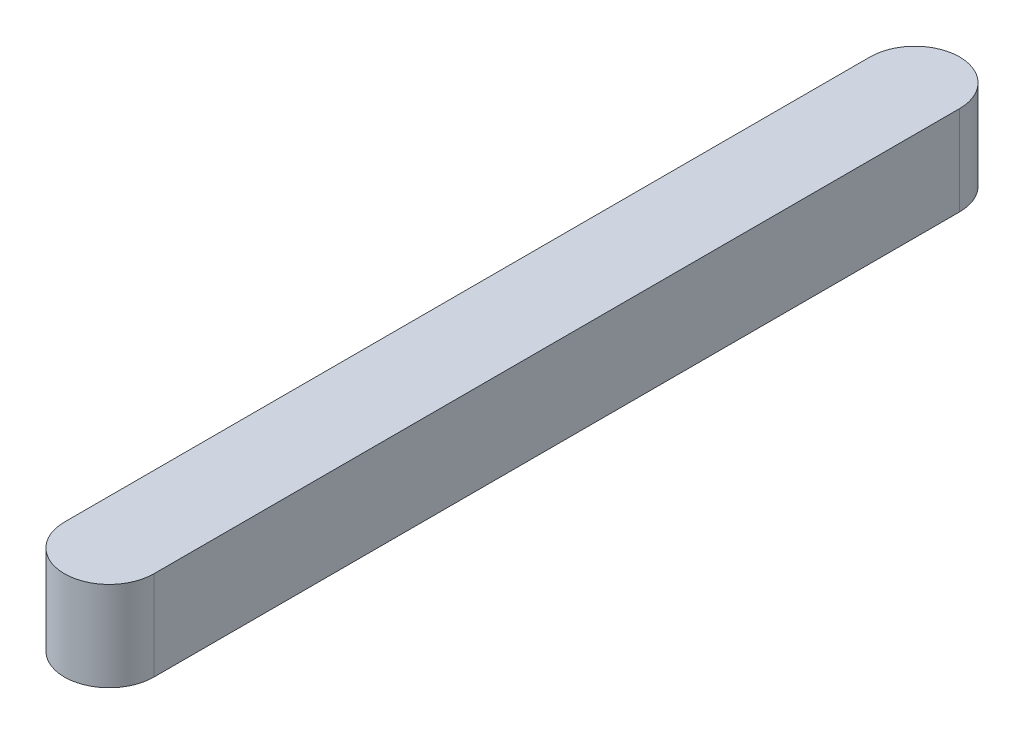
ISO-10303-21;
HEADER;
FILE_DESCRIPTION(('STEP AP214'),'2;1');
FILE_NAME('part.step','',(''),(''),'','','');
FILE_SCHEMA(('AUTOMOTIVE_DESIGN { 1 0 10303 214 1 1 1 1 }'));
ENDSEC;
DATA;
#1=APPLICATION_CONTEXT('core data for automotive mechanical design processes');
#2=APPLICATION_PROTOCOL_DEFINITION('international standard','automotive_design',2000,#1);
#3=PRODUCT_CONTEXT('',#1,'mechanical');
#4=PRODUCT('Part','Part','',(#3));
#5=PRODUCT_RELATED_PRODUCT_CATEGORY('part','',(#4));
#6=PRODUCT_DEFINITION_FORMATION('','',#4);
#7=PRODUCT_DEFINITION_CONTEXT('part definition',#1,'design');
#8=PRODUCT_DEFINITION('design','',#6,#7);
#9=PRODUCT_DEFINITION_SHAPE('','',#8);
#10=(LENGTH_UNIT() NAMED_UNIT(*) SI_UNIT(.MILLI.,.METRE.));
#11=(NAMED_UNIT(*) PLANE_ANGLE_UNIT() SI_UNIT($,.RADIAN.));
#12=(NAMED_UNIT(*) SI_UNIT($,.STERADIAN.) SOLID_ANGLE_UNIT());
#13=UNCERTAINTY_MEASURE_WITH_UNIT(LENGTH_MEASURE(1.E-05),#10,'distance_accuracy_value','');
#14=(GEOMETRIC_REPRESENTATION_CONTEXT(3) GLOBAL_UNCERTAINTY_ASSIGNED_CONTEXT((#13)) GLOBAL_UNIT_ASSIGNED_CONTEXT((#10,
#11,#12)) REPRESENTATION_CONTEXT('',''));
#15=CARTESIAN_POINT('',(0.,0.,0.));
#16=DIRECTION('',(0.,0.,1.));
#17=DIRECTION('',(1.,0.,0.));
#18=AXIS2_PLACEMENT_3D('',#15,#16,#17);
#19=CARTESIAN_POINT('',(0.,1.,9.));
#20=DIRECTION('',(0.,-1.,0.));
#21=DIRECTION('',(0.,0.,-1.));
#22=AXIS2_PLACEMENT_3D('',#19,#20,#21);
#23=CYLINDRICAL_SURFACE('',#22,1.);
#24=CARTESIAN_POINT('',(0.,-1.,9.));
#25=DIRECTION('',(0.,-1.,0.));
#26=DIRECTION('',(0.,0.,-1.));
#27=AXIS2_PLACEMENT_3D('',#24,#25,#26);
#28=CIRCLE('',#27,1.);
#29=CARTESIAN_POINT('',(-1.,-1.,9.));
#30=VERTEX_POINT('',#29);
#31=CARTESIAN_POINT('',(1.,-1.,9.));
#32=VERTEX_POINT('',#31);
#33=EDGE_CURVE('E20',#30,#32,#28,.F.);
#34=ORIENTED_EDGE('',*,*,#33,.T.);
#35=DIRECTION('',(0.,1.,0.));
#36=VECTOR('',#35,1.);
#37=CARTESIAN_POINT('',(1.,-1.,9.));
#38=LINE('',#37,#36);
#39=CARTESIAN_POINT('',(1.,1.,9.));
#40=VERTEX_POINT('',#39);
#41=EDGE_CURVE('E76',#32,#40,#38,.T.);
#42=ORIENTED_EDGE('',*,*,#41,.T.);
#43=CARTESIAN_POINT('',(0.,1.,9.));
#44=DIRECTION('',(0.,-1.,0.));
#45=DIRECTION('',(0.,0.,-1.));
#46=AXIS2_PLACEMENT_3D('',#43,#44,#45);
#47=CIRCLE('',#46,1.);
#48=CARTESIAN_POINT('',(-1.,1.,9.));
#49=VERTEX_POINT('',#48);
#50=EDGE_CURVE('E64',#40,#49,#47,.T.);
#51=ORIENTED_EDGE('',*,*,#50,.T.);
#52=DIRECTION('',(0.,1.,0.));
#53=VECTOR('',#52,1.);
#54=CARTESIAN_POINT('',(-1.,-1.,9.));
#55=LINE('',#54,#53);
#56=EDGE_CURVE('E83',#49,#30,#55,.F.);
#57=ORIENTED_EDGE('',*,*,#56,.T.);
#58=EDGE_LOOP('',(#34,#42,#51,#57));
#59=FACE_BOUND('',#58,.T.);
#60=ADVANCED_FACE('F17',(#59),#23,.T.);
#61=CARTESIAN_POINT('',(0.,-1.,-9.));
#62=DIRECTION('',(0.,1.,0.));
#63=DIRECTION('',(0.,0.,1.));
#64=AXIS2_PLACEMENT_3D('',#61,#62,#63);
#65=CYLINDRICAL_SURFACE('',#64,1.);
#66=CARTESIAN_POINT('',(0.,-1.,-9.));
#67=DIRECTION('',(0.,1.,0.));
#68=DIRECTION('',(0.,0.,1.));
#69=AXIS2_PLACEMENT_3D('',#66,#67,#68);
#70=CIRCLE('',#69,1.);
#71=CARTESIAN_POINT('',(1.,-1.,-9.));
#72=VERTEX_POINT('',#71);
#73=CARTESIAN_POINT('',(-1.,-1.,-9.));
#74=VERTEX_POINT('',#73);
#75=EDGE_CURVE('E35',#72,#74,#70,.T.);
#76=ORIENTED_EDGE('',*,*,#75,.T.);
#77=DIRECTION('',(0.,1.,0.));
#78=VECTOR('',#77,1.);
#79=CARTESIAN_POINT('',(-1.,-1.,-9.));
#80=LINE('',#79,#78);
#81=CARTESIAN_POINT('',(-1.,1.,-9.));
#82=VERTEX_POINT('',#81);
#83=EDGE_CURVE('E86',#74,#82,#80,.T.);
#84=ORIENTED_EDGE('',*,*,#83,.T.);
#85=CARTESIAN_POINT('',(0.,1.,-9.));
#86=DIRECTION('',(0.,-1.,0.));
#87=DIRECTION('',(0.,0.,-1.));
#88=AXIS2_PLACEMENT_3D('',#85,#86,#87);
#89=CIRCLE('',#88,1.);
#90=CARTESIAN_POINT('',(1.,1.,-9.));
#91=VERTEX_POINT('',#90);
#92=EDGE_CURVE('E56',#82,#91,#89,.T.);
#93=ORIENTED_EDGE('',*,*,#92,.T.);
#94=DIRECTION('',(0.,1.,0.));
#95=VECTOR('',#94,1.);
#96=CARTESIAN_POINT('',(1.,-1.,-9.));
#97=LINE('',#96,#95);
#98=EDGE_CURVE('E77',#91,#72,#97,.F.);
#99=ORIENTED_EDGE('',*,*,#98,.T.);
#100=EDGE_LOOP('',(#76,#84,#93,#99));
#101=FACE_BOUND('',#100,.T.);
#102=ADVANCED_FACE('F91',(#101),#65,.T.);
#103=CARTESIAN_POINT('',(-1.,1.,10.));
#104=DIRECTION('',(0.,-1.,0.));
#105=DIRECTION('',(0.,0.,-1.));
#106=AXIS2_PLACEMENT_3D('',#103,#104,#105);
#107=PLANE('',#106);
#108=ORIENTED_EDGE('',*,*,#92,.F.);
#109=DIRECTION('',(0.,0.,-1.));
#110=VECTOR('',#109,1.);
#111=CARTESIAN_POINT('',(-1.,1.,10.));
#112=LINE('',#111,#110);
#113=EDGE_CURVE('E68',#82,#49,#112,.F.);
#114=ORIENTED_EDGE('',*,*,#113,.T.);
#115=ORIENTED_EDGE('',*,*,#50,.F.);
#116=DIRECTION('',(0.,0.,1.));
#117=VECTOR('',#116,1.);
#118=CARTESIAN_POINT('',(1.,1.,10.));
#119=LINE('',#118,#117);
#120=EDGE_CURVE('E67',#40,#91,#119,.F.);
#121=ORIENTED_EDGE('',*,*,#120,.T.);
#122=EDGE_LOOP('',(#108,#114,#115,#121));
#123=FACE_BOUND('',#122,.T.);
#124=ADVANCED_FACE('F66',(#123),#107,.F.);
#125=CARTESIAN_POINT('',(1.,-1.,10.));
#126=DIRECTION('',(-1.,0.,0.));
#127=DIRECTION('',(0.,0.,1.));
#128=AXIS2_PLACEMENT_3D('',#125,#126,#127);
#129=PLANE('',#128);
#130=ORIENTED_EDGE('',*,*,#98,.F.);
#131=ORIENTED_EDGE('',*,*,#120,.F.);
#132=ORIENTED_EDGE('',*,*,#41,.F.);
#133=DIRECTION('',(0.,0.,1.));
#134=VECTOR('',#133,1.);
#135=CARTESIAN_POINT('',(1.,-1.,10.));
#136=LINE('',#135,#134);
#137=EDGE_CURVE('E26',#32,#72,#136,.F.);
#138=ORIENTED_EDGE('',*,*,#137,.T.);
#139=EDGE_LOOP('',(#130,#131,#132,#138));
#140=FACE_BOUND('',#139,.T.);
#141=ADVANCED_FACE('F74',(#140),#129,.F.);
#142=CARTESIAN_POINT('',(-1.,-1.,10.));
#143=DIRECTION('',(1.,0.,0.));
#144=DIRECTION('',(0.,0.,-1.));
#145=AXIS2_PLACEMENT_3D('',#142,#143,#144);
#146=PLANE('',#145);
#147=ORIENTED_EDGE('',*,*,#83,.F.);
#148=DIRECTION('',(0.,0.,1.));
#149=VECTOR('',#148,1.);
#150=CARTESIAN_POINT('',(-1.,-1.,10.));
#151=LINE('',#150,#149);
#152=EDGE_CURVE('E11',#74,#30,#151,.T.);
#153=ORIENTED_EDGE('',*,*,#152,.T.);
#154=ORIENTED_EDGE('',*,*,#56,.F.);
#155=ORIENTED_EDGE('',*,*,#113,.F.);
#156=EDGE_LOOP('',(#147,#153,#154,#155));
#157=FACE_BOUND('',#156,.T.);
#158=ADVANCED_FACE('F89',(#157),#146,.F.);
#159=CARTESIAN_POINT('',(-1.,-1.,10.));
#160=DIRECTION('',(0.,1.,0.));
#161=DIRECTION('',(0.,0.,1.));
#162=AXIS2_PLACEMENT_3D('',#159,#160,#161);
#163=PLANE('',#162);
#164=ORIENTED_EDGE('',*,*,#75,.F.);
#165=ORIENTED_EDGE('',*,*,#137,.F.);
#166=ORIENTED_EDGE('',*,*,#33,.F.);
#167=ORIENTED_EDGE('',*,*,#152,.F.);
#168=EDGE_LOOP('',(#164,#165,#166,#167));
#169=FACE_BOUND('',#168,.T.);
#170=ADVANCED_FACE('F90',(#169),#163,.F.);
#171=CLOSED_SHELL('',(#60,#102,#124,#141,#158,#170));
#172=MANIFOLD_SOLID_BREP('B1',#171);
#173=ADVANCED_BREP_SHAPE_REPRESENTATION('',(#18,#172),#14);
#174=SHAPE_DEFINITION_REPRESENTATION(#9,#173);
ENDSEC;
END-ISO-10303-21;
